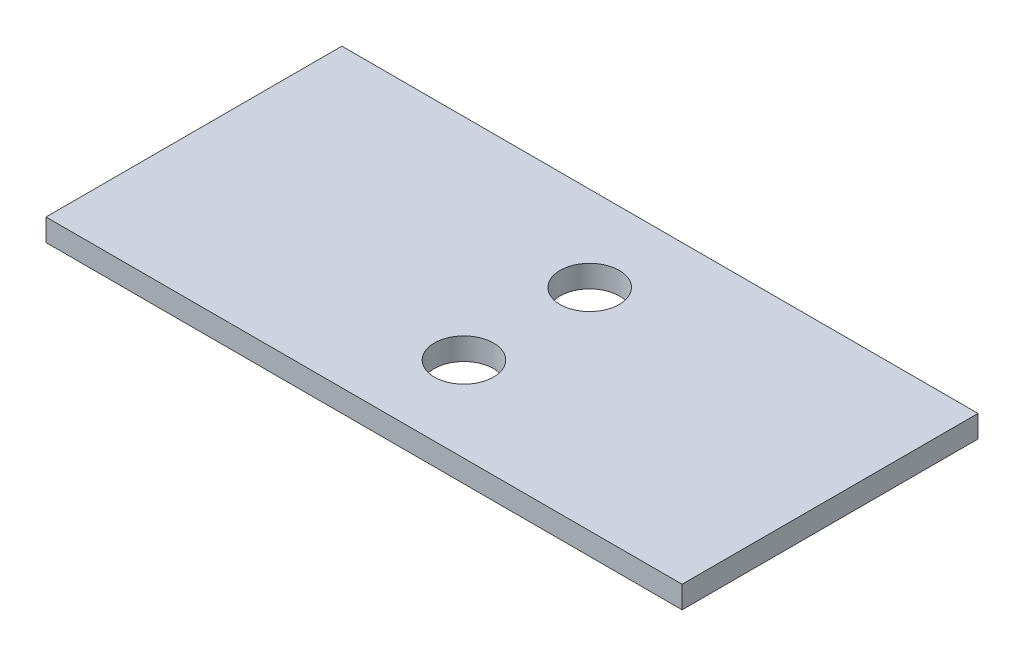
ISO-10303-21;
HEADER;
FILE_DESCRIPTION(('STEP AP214'),'2;1');
FILE_NAME('part.step','',(''),(''),'','','');
FILE_SCHEMA(('AUTOMOTIVE_DESIGN { 1 0 10303 214 1 1 1 1 }'));
ENDSEC;
DATA;
#1=APPLICATION_CONTEXT('core data for automotive mechanical design processes');
#2=APPLICATION_PROTOCOL_DEFINITION('international standard','automotive_design',2000,#1);
#3=PRODUCT_CONTEXT('',#1,'mechanical');
#4=PRODUCT('Part','Part','',(#3));
#5=PRODUCT_RELATED_PRODUCT_CATEGORY('part','',(#4));
#6=PRODUCT_DEFINITION_FORMATION('','',#4);
#7=PRODUCT_DEFINITION_CONTEXT('part definition',#1,'design');
#8=PRODUCT_DEFINITION('design','',#6,#7);
#9=PRODUCT_DEFINITION_SHAPE('','',#8);
#10=(LENGTH_UNIT() NAMED_UNIT(*) SI_UNIT(.MILLI.,.METRE.));
#11=(NAMED_UNIT(*) PLANE_ANGLE_UNIT() SI_UNIT($,.RADIAN.));
#12=(NAMED_UNIT(*) SI_UNIT($,.STERADIAN.) SOLID_ANGLE_UNIT());
#13=UNCERTAINTY_MEASURE_WITH_UNIT(LENGTH_MEASURE(1.E-05),#10,'distance_accuracy_value','');
#14=(GEOMETRIC_REPRESENTATION_CONTEXT(3) GLOBAL_UNCERTAINTY_ASSIGNED_CONTEXT((#13)) GLOBAL_UNIT_ASSIGNED_CONTEXT((#10,
#11,#12)) REPRESENTATION_CONTEXT('',''));
#15=CARTESIAN_POINT('',(0.,0.,0.));
#16=DIRECTION('',(0.,0.,1.));
#17=DIRECTION('',(1.,0.,0.));
#18=AXIS2_PLACEMENT_3D('',#15,#16,#17);
#19=CARTESIAN_POINT('',(0.,1.5,0.));
#20=DIRECTION('',(0.,-1.,0.));
#21=DIRECTION('',(0.,0.,-1.));
#22=AXIS2_PLACEMENT_3D('',#19,#20,#21);
#23=PLANE('',#22);
#24=DIRECTION('',(0.,0.,1.));
#25=VECTOR('',#24,1.);
#26=CARTESIAN_POINT('',(0.,1.5,0.));
#27=LINE('',#26,#25);
#28=CARTESIAN_POINT('',(0.,1.5,-20.));
#29=VERTEX_POINT('',#28);
#30=CARTESIAN_POINT('',(0.,1.5,0.));
#31=VERTEX_POINT('',#30);
#32=EDGE_CURVE('E85',#29,#31,#27,.T.);
#33=ORIENTED_EDGE('',*,*,#32,.T.);
#34=DIRECTION('',(1.,0.,0.));
#35=VECTOR('',#34,1.);
#36=CARTESIAN_POINT('',(0.,1.5,0.));
#37=LINE('',#36,#35);
#38=CARTESIAN_POINT('',(43.,1.5,0.));
#39=VERTEX_POINT('',#38);
#40=EDGE_CURVE('E80',#31,#39,#37,.T.);
#41=ORIENTED_EDGE('',*,*,#40,.T.);
#42=DIRECTION('',(0.,0.,-1.));
#43=VECTOR('',#42,1.);
#44=CARTESIAN_POINT('',(43.,1.5,0.));
#45=LINE('',#44,#43);
#46=CARTESIAN_POINT('',(43.,1.5,-20.));
#47=VERTEX_POINT('',#46);
#48=EDGE_CURVE('E83',#39,#47,#45,.T.);
#49=ORIENTED_EDGE('',*,*,#48,.T.);
#50=DIRECTION('',(-1.,0.,0.));
#51=VECTOR('',#50,1.);
#52=CARTESIAN_POINT('',(0.,1.5,-20.));
#53=LINE('',#52,#51);
#54=EDGE_CURVE('E50',#47,#29,#53,.T.);
#55=ORIENTED_EDGE('',*,*,#54,.T.);
#56=EDGE_LOOP('',(#33,#41,#49,#55));
#57=FACE_BOUND('',#56,.T.);
#58=CARTESIAN_POINT('',(22.5,1.5,-14.25));
#59=DIRECTION('',(0.,1.,0.));
#60=DIRECTION('',(0.,0.,1.));
#61=AXIS2_PLACEMENT_3D('',#58,#59,#60);
#62=CIRCLE('',#61,2.00000000000001);
#63=CARTESIAN_POINT('',(22.5,1.5,-12.25));
#64=VERTEX_POINT('',#63);
#65=EDGE_CURVE('E100',#64,#64,#62,.T.);
#66=ORIENTED_EDGE('',*,*,#65,.F.);
#67=EDGE_LOOP('',(#66));
#68=FACE_BOUND('',#67,.T.);
#69=CARTESIAN_POINT('',(22.5,1.5,-5.75));
#70=DIRECTION('',(0.,1.,0.));
#71=DIRECTION('',(0.,0.,-1.));
#72=AXIS2_PLACEMENT_3D('',#69,#70,#71);
#73=CIRCLE('',#72,2.);
#74=CARTESIAN_POINT('',(22.5,1.5,-7.75));
#75=VERTEX_POINT('',#74);
#76=EDGE_CURVE('E115',#75,#75,#73,.T.);
#77=ORIENTED_EDGE('',*,*,#76,.F.);
#78=EDGE_LOOP('',(#77));
#79=FACE_BOUND('',#78,.T.);
#80=ADVANCED_FACE('F33',(#57,#68,#79),#23,.F.);
#81=CARTESIAN_POINT('',(0.,0.,0.));
#82=DIRECTION('',(0.,-1.,0.));
#83=DIRECTION('',(0.,0.,-1.));
#84=AXIS2_PLACEMENT_3D('',#81,#82,#83);
#85=PLANE('',#84);
#86=CARTESIAN_POINT('',(22.5,0.,-14.25));
#87=DIRECTION('',(0.,1.,0.));
#88=DIRECTION('',(0.,0.,1.));
#89=AXIS2_PLACEMENT_3D('',#86,#87,#88);
#90=CIRCLE('',#89,2.00000000000001);
#91=CARTESIAN_POINT('',(22.5,0.,-12.25));
#92=VERTEX_POINT('',#91);
#93=EDGE_CURVE('E112',#92,#92,#90,.T.);
#94=ORIENTED_EDGE('',*,*,#93,.T.);
#95=EDGE_LOOP('',(#94));
#96=FACE_BOUND('',#95,.T.);
#97=DIRECTION('',(0.,0.,1.));
#98=VECTOR('',#97,1.);
#99=CARTESIAN_POINT('',(0.,0.,0.));
#100=LINE('',#99,#98);
#101=CARTESIAN_POINT('',(0.,0.,-20.));
#102=VERTEX_POINT('',#101);
#103=CARTESIAN_POINT('',(0.,0.,0.));
#104=VERTEX_POINT('',#103);
#105=EDGE_CURVE('E97',#102,#104,#100,.T.);
#106=ORIENTED_EDGE('',*,*,#105,.F.);
#107=DIRECTION('',(-1.,0.,0.));
#108=VECTOR('',#107,1.);
#109=CARTESIAN_POINT('',(0.,0.,-20.));
#110=LINE('',#109,#108);
#111=CARTESIAN_POINT('',(43.,0.,-20.));
#112=VERTEX_POINT('',#111);
#113=EDGE_CURVE('E73',#112,#102,#110,.T.);
#114=ORIENTED_EDGE('',*,*,#113,.F.);
#115=DIRECTION('',(0.,0.,-1.));
#116=VECTOR('',#115,1.);
#117=CARTESIAN_POINT('',(43.,0.,0.));
#118=LINE('',#117,#116);
#119=CARTESIAN_POINT('',(43.,0.,0.));
#120=VERTEX_POINT('',#119);
#121=EDGE_CURVE('E67',#120,#112,#118,.T.);
#122=ORIENTED_EDGE('',*,*,#121,.F.);
#123=DIRECTION('',(1.,0.,0.));
#124=VECTOR('',#123,1.);
#125=CARTESIAN_POINT('',(0.,0.,0.));
#126=LINE('',#125,#124);
#127=EDGE_CURVE('E89',#104,#120,#126,.T.);
#128=ORIENTED_EDGE('',*,*,#127,.F.);
#129=EDGE_LOOP('',(#106,#114,#122,#128));
#130=FACE_BOUND('',#129,.T.);
#131=CARTESIAN_POINT('',(22.5,0.,-5.75));
#132=DIRECTION('',(0.,1.,0.));
#133=DIRECTION('',(0.,0.,-1.));
#134=AXIS2_PLACEMENT_3D('',#131,#132,#133);
#135=CIRCLE('',#134,2.);
#136=CARTESIAN_POINT('',(22.5,0.,-7.75));
#137=VERTEX_POINT('',#136);
#138=EDGE_CURVE('E118',#137,#137,#135,.T.);
#139=ORIENTED_EDGE('',*,*,#138,.T.);
#140=EDGE_LOOP('',(#139));
#141=FACE_BOUND('',#140,.T.);
#142=ADVANCED_FACE('F108',(#96,#130,#141),#85,.T.);
#143=CARTESIAN_POINT('',(0.,1.5,0.));
#144=DIRECTION('',(1.,0.,0.));
#145=DIRECTION('',(0.,0.,-1.));
#146=AXIS2_PLACEMENT_3D('',#143,#144,#145);
#147=PLANE('',#146);
#148=ORIENTED_EDGE('',*,*,#105,.T.);
#149=DIRECTION('',(0.,-1.,0.));
#150=VECTOR('',#149,1.);
#151=CARTESIAN_POINT('',(0.,1.5,0.));
#152=LINE('',#151,#150);
#153=EDGE_CURVE('E11',#31,#104,#152,.T.);
#154=ORIENTED_EDGE('',*,*,#153,.F.);
#155=ORIENTED_EDGE('',*,*,#32,.F.);
#156=DIRECTION('',(0.,-1.,0.));
#157=VECTOR('',#156,1.);
#158=CARTESIAN_POINT('',(0.,1.5,-20.));
#159=LINE('',#158,#157);
#160=EDGE_CURVE('E93',#29,#102,#159,.T.);
#161=ORIENTED_EDGE('',*,*,#160,.T.);
#162=EDGE_LOOP('',(#148,#154,#155,#161));
#163=FACE_BOUND('',#162,.T.);
#164=ADVANCED_FACE('F35',(#163),#147,.F.);
#165=CARTESIAN_POINT('',(0.,1.5,0.));
#166=DIRECTION('',(0.,0.,-1.));
#167=DIRECTION('',(-1.,0.,0.));
#168=AXIS2_PLACEMENT_3D('',#165,#166,#167);
#169=PLANE('',#168);
#170=ORIENTED_EDGE('',*,*,#127,.T.);
#171=DIRECTION('',(0.,-1.,0.));
#172=VECTOR('',#171,1.);
#173=CARTESIAN_POINT('',(43.,1.5,0.));
#174=LINE('',#173,#172);
#175=EDGE_CURVE('E42',#39,#120,#174,.T.);
#176=ORIENTED_EDGE('',*,*,#175,.F.);
#177=ORIENTED_EDGE('',*,*,#40,.F.);
#178=ORIENTED_EDGE('',*,*,#153,.T.);
#179=EDGE_LOOP('',(#170,#176,#177,#178));
#180=FACE_BOUND('',#179,.T.);
#181=ADVANCED_FACE('F88',(#180),#169,.F.);
#182=CARTESIAN_POINT('',(43.,1.5,0.));
#183=DIRECTION('',(-1.,0.,0.));
#184=DIRECTION('',(0.,0.,1.));
#185=AXIS2_PLACEMENT_3D('',#182,#183,#184);
#186=PLANE('',#185);
#187=ORIENTED_EDGE('',*,*,#121,.T.);
#188=DIRECTION('',(0.,-1.,0.));
#189=VECTOR('',#188,1.);
#190=CARTESIAN_POINT('',(43.,1.5,-20.));
#191=LINE('',#190,#189);
#192=EDGE_CURVE('E90',#47,#112,#191,.T.);
#193=ORIENTED_EDGE('',*,*,#192,.F.);
#194=ORIENTED_EDGE('',*,*,#48,.F.);
#195=ORIENTED_EDGE('',*,*,#175,.T.);
#196=EDGE_LOOP('',(#187,#193,#194,#195));
#197=FACE_BOUND('',#196,.T.);
#198=ADVANCED_FACE('F91',(#197),#186,.F.);
#199=CARTESIAN_POINT('',(0.,1.5,-20.));
#200=DIRECTION('',(0.,0.,1.));
#201=DIRECTION('',(1.,0.,0.));
#202=AXIS2_PLACEMENT_3D('',#199,#200,#201);
#203=PLANE('',#202);
#204=ORIENTED_EDGE('',*,*,#113,.T.);
#205=ORIENTED_EDGE('',*,*,#160,.F.);
#206=ORIENTED_EDGE('',*,*,#54,.F.);
#207=ORIENTED_EDGE('',*,*,#192,.T.);
#208=EDGE_LOOP('',(#204,#205,#206,#207));
#209=FACE_BOUND('',#208,.T.);
#210=ADVANCED_FACE('F105',(#209),#203,.F.);
#211=CARTESIAN_POINT('',(22.5,1.5,-14.25));
#212=DIRECTION('',(0.,-1.,0.));
#213=DIRECTION('',(0.,0.,-1.));
#214=AXIS2_PLACEMENT_3D('',#211,#212,#213);
#215=CYLINDRICAL_SURFACE('',#214,2.00000000000001);
#216=ORIENTED_EDGE('',*,*,#65,.T.);
#217=EDGE_LOOP('',(#216));
#218=FACE_BOUND('',#217,.T.);
#219=ORIENTED_EDGE('',*,*,#93,.F.);
#220=EDGE_LOOP('',(#219));
#221=FACE_BOUND('',#220,.T.);
#222=ADVANCED_FACE('F135',(#218,#221),#215,.F.);
#223=CARTESIAN_POINT('',(22.5,1.5,-5.75));
#224=DIRECTION('',(0.,-1.,0.));
#225=DIRECTION('',(0.,0.,-1.));
#226=AXIS2_PLACEMENT_3D('',#223,#224,#225);
#227=CYLINDRICAL_SURFACE('',#226,2.);
#228=ORIENTED_EDGE('',*,*,#76,.T.);
#229=EDGE_LOOP('',(#228));
#230=FACE_BOUND('',#229,.T.);
#231=ORIENTED_EDGE('',*,*,#138,.F.);
#232=EDGE_LOOP('',(#231));
#233=FACE_BOUND('',#232,.T.);
#234=ADVANCED_FACE('F124',(#230,#233),#227,.F.);
#235=CLOSED_SHELL('',(#80,#142,#164,#181,#198,#210,#222,#234));
#236=MANIFOLD_SOLID_BREP('B2',#235);
#237=ADVANCED_BREP_SHAPE_REPRESENTATION('',(#18,#236),#14);
#238=SHAPE_DEFINITION_REPRESENTATION(#9,#237);
ENDSEC;
END-ISO-10303-21;
